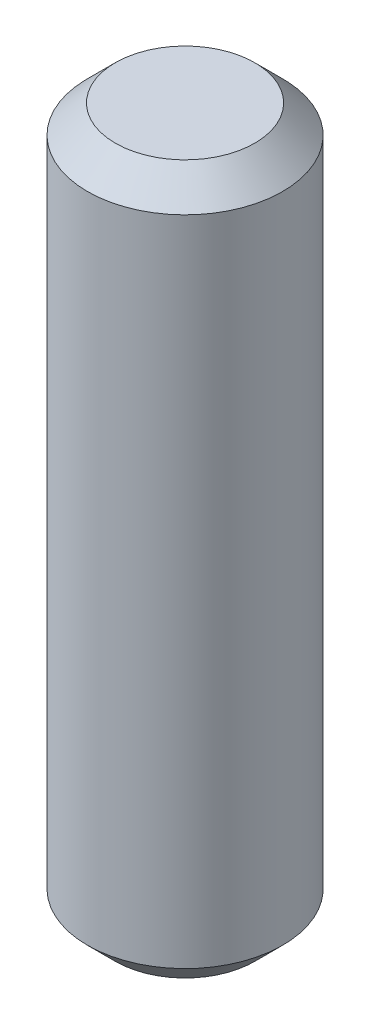
ISO-10303-21;
HEADER;
FILE_DESCRIPTION(('STEP AP214'),'2;1');
FILE_NAME('part.step','',(''),(''),'','','');
FILE_SCHEMA(('AUTOMOTIVE_DESIGN { 1 0 10303 214 1 1 1 1 }'));
ENDSEC;
DATA;
#1=APPLICATION_CONTEXT('core data for automotive mechanical design processes');
#2=APPLICATION_PROTOCOL_DEFINITION('international standard','automotive_design',2000,#1);
#3=PRODUCT_CONTEXT('',#1,'mechanical');
#4=PRODUCT('Part','Part','',(#3));
#5=PRODUCT_RELATED_PRODUCT_CATEGORY('part','',(#4));
#6=PRODUCT_DEFINITION_FORMATION('','',#4);
#7=PRODUCT_DEFINITION_CONTEXT('part definition',#1,'design');
#8=PRODUCT_DEFINITION('design','',#6,#7);
#9=PRODUCT_DEFINITION_SHAPE('','',#8);
#10=(LENGTH_UNIT() NAMED_UNIT(*) SI_UNIT(.MILLI.,.METRE.));
#11=(NAMED_UNIT(*) PLANE_ANGLE_UNIT() SI_UNIT($,.RADIAN.));
#12=(NAMED_UNIT(*) SI_UNIT($,.STERADIAN.) SOLID_ANGLE_UNIT());
#13=UNCERTAINTY_MEASURE_WITH_UNIT(LENGTH_MEASURE(1.E-05),#10,'distance_accuracy_value','');
#14=(GEOMETRIC_REPRESENTATION_CONTEXT(3) GLOBAL_UNCERTAINTY_ASSIGNED_CONTEXT((#13)) GLOBAL_UNIT_ASSIGNED_CONTEXT((#10,
#11,#12)) REPRESENTATION_CONTEXT('',''));
#15=CARTESIAN_POINT('',(0.,0.,0.));
#16=DIRECTION('',(0.,0.,1.));
#17=DIRECTION('',(1.,0.,0.));
#18=AXIS2_PLACEMENT_3D('',#15,#16,#17);
#19=CARTESIAN_POINT('',(0.,12.7,0.));
#20=DIRECTION('',(0.,-1.,0.));
#21=DIRECTION('',(0.,0.,-1.));
#22=AXIS2_PLACEMENT_3D('',#19,#20,#21);
#23=CYLINDRICAL_SURFACE('',#22,1.75);
#24=CARTESIAN_POINT('',(0.,0.5,0.));
#25=DIRECTION('',(0.,1.,0.));
#26=DIRECTION('',(0.,0.,1.));
#27=AXIS2_PLACEMENT_3D('',#24,#25,#26);
#28=CIRCLE('',#27,1.75);
#29=CARTESIAN_POINT('',(0.,0.5,1.75));
#30=VERTEX_POINT('',#29);
#31=EDGE_CURVE('E57',#30,#30,#28,.T.);
#32=ORIENTED_EDGE('',*,*,#31,.T.);
#33=EDGE_LOOP('',(#32));
#34=FACE_BOUND('',#33,.T.);
#35=CARTESIAN_POINT('',(0.,12.2,0.));
#36=DIRECTION('',(0.,1.,0.));
#37=DIRECTION('',(0.,0.,1.));
#38=AXIS2_PLACEMENT_3D('',#35,#36,#37);
#39=CIRCLE('',#38,1.75);
#40=CARTESIAN_POINT('',(0.,12.2,1.75));
#41=VERTEX_POINT('',#40);
#42=EDGE_CURVE('E61',#41,#41,#39,.F.);
#43=ORIENTED_EDGE('',*,*,#42,.T.);
#44=EDGE_LOOP('',(#43));
#45=FACE_BOUND('',#44,.T.);
#46=ADVANCED_FACE('F45',(#34,#45),#23,.T.);
#47=CARTESIAN_POINT('',(0.,12.7,0.));
#48=DIRECTION('',(0.,1.,0.));
#49=DIRECTION('',(0.,0.,1.));
#50=AXIS2_PLACEMENT_3D('',#47,#48,#49);
#51=PLANE('',#50);
#52=CARTESIAN_POINT('',(0.,12.7,0.));
#53=DIRECTION('',(0.,1.,0.));
#54=DIRECTION('',(0.,0.,1.));
#55=AXIS2_PLACEMENT_3D('',#52,#53,#54);
#56=CIRCLE('',#55,1.25);
#57=CARTESIAN_POINT('',(0.,12.7,1.25));
#58=VERTEX_POINT('',#57);
#59=EDGE_CURVE('E10',#58,#58,#56,.T.);
#60=ORIENTED_EDGE('',*,*,#59,.T.);
#61=EDGE_LOOP('',(#60));
#62=FACE_BOUND('',#61,.T.);
#63=ADVANCED_FACE('F76',(#62),#51,.T.);
#64=CARTESIAN_POINT('',(0.,0.,0.));
#65=DIRECTION('',(0.,1.,0.));
#66=DIRECTION('',(0.,0.,1.));
#67=AXIS2_PLACEMENT_3D('',#64,#65,#66);
#68=PLANE('',#67);
#69=CARTESIAN_POINT('',(0.,0.,0.));
#70=DIRECTION('',(0.,1.,0.));
#71=DIRECTION('',(0.,0.,1.));
#72=AXIS2_PLACEMENT_3D('',#69,#70,#71);
#73=CIRCLE('',#72,1.25);
#74=CARTESIAN_POINT('',(0.,0.,1.25));
#75=VERTEX_POINT('',#74);
#76=EDGE_CURVE('E53',#75,#75,#73,.F.);
#77=ORIENTED_EDGE('',*,*,#76,.T.);
#78=EDGE_LOOP('',(#77));
#79=FACE_BOUND('',#78,.T.);
#80=ADVANCED_FACE('F73',(#79),#68,.F.);
#81=CARTESIAN_POINT('',(0.,0.5,0.));
#82=DIRECTION('',(0.,1.,0.));
#83=DIRECTION('',(0.,0.,1.));
#84=AXIS2_PLACEMENT_3D('',#81,#82,#83);
#85=CONICAL_SURFACE('',#84,1.75,0.78539816339745);
#86=ORIENTED_EDGE('',*,*,#76,.F.);
#87=EDGE_LOOP('',(#86));
#88=FACE_BOUND('',#87,.T.);
#89=ORIENTED_EDGE('',*,*,#31,.F.);
#90=EDGE_LOOP('',(#89));
#91=FACE_BOUND('',#90,.T.);
#92=ADVANCED_FACE('F70',(#88,#91),#85,.T.);
#93=CARTESIAN_POINT('',(0.,12.7,0.));
#94=DIRECTION('',(0.,-1.,0.));
#95=DIRECTION('',(0.,0.,-1.));
#96=AXIS2_PLACEMENT_3D('',#93,#94,#95);
#97=CONICAL_SURFACE('',#96,1.25,0.785398163397447);
#98=ORIENTED_EDGE('',*,*,#42,.F.);
#99=EDGE_LOOP('',(#98));
#100=FACE_BOUND('',#99,.T.);
#101=ORIENTED_EDGE('',*,*,#59,.F.);
#102=EDGE_LOOP('',(#101));
#103=FACE_BOUND('',#102,.T.);
#104=ADVANCED_FACE('F48',(#100,#103),#97,.T.);
#105=CLOSED_SHELL('',(#46,#63,#80,#92,#104));
#106=MANIFOLD_SOLID_BREP('B2',#105);
#107=ADVANCED_BREP_SHAPE_REPRESENTATION('',(#18,#106),#14);
#108=SHAPE_DEFINITION_REPRESENTATION(#9,#107);
ENDSEC;
END-ISO-10303-21;
